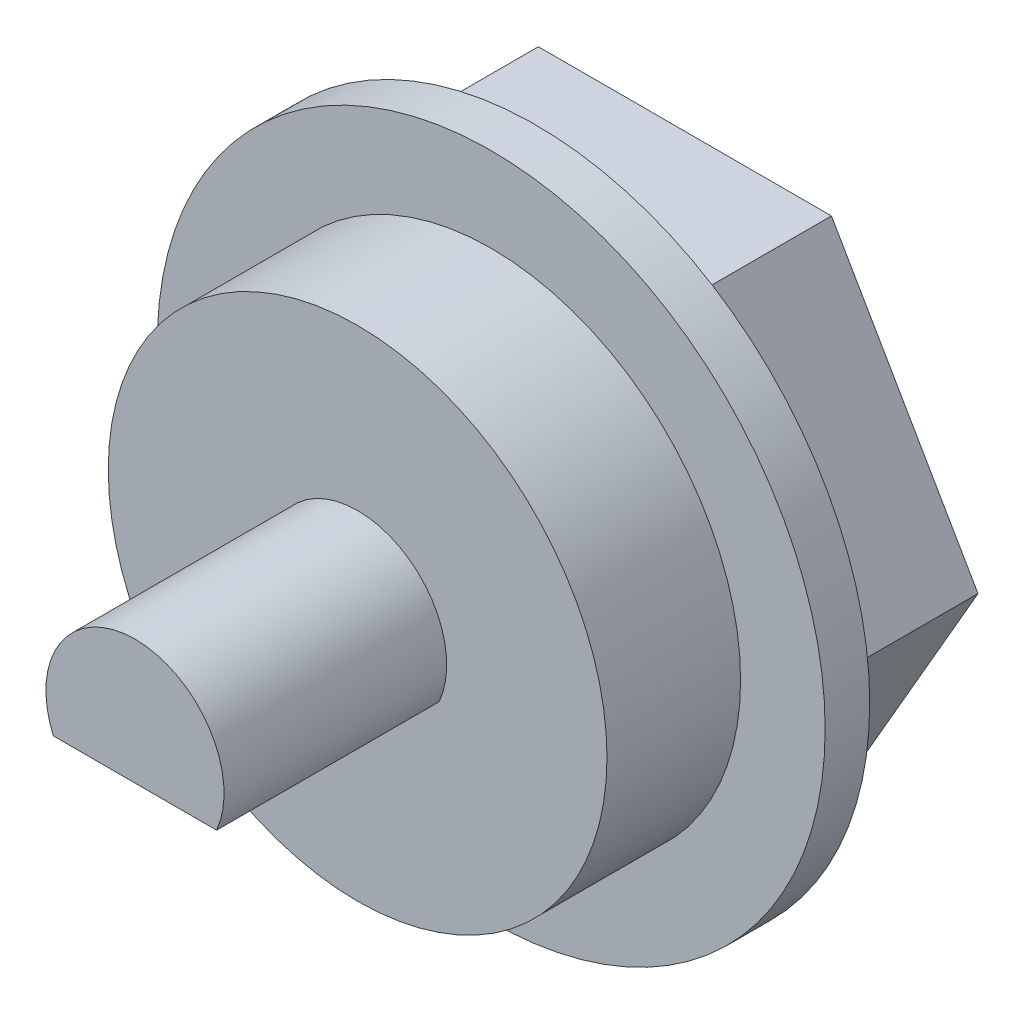
ISO-10303-21;
HEADER;
FILE_DESCRIPTION(('STEP AP214'),'2;1');
FILE_NAME('part.step','',(''),(''),'','','');
FILE_SCHEMA(('AUTOMOTIVE_DESIGN { 1 0 10303 214 1 1 1 1 }'));
ENDSEC;
DATA;
#1=APPLICATION_CONTEXT('core data for automotive mechanical design processes');
#2=APPLICATION_PROTOCOL_DEFINITION('international standard','automotive_design',2000,#1);
#3=PRODUCT_CONTEXT('',#1,'mechanical');
#4=PRODUCT('Part','Part','',(#3));
#5=PRODUCT_RELATED_PRODUCT_CATEGORY('part','',(#4));
#6=PRODUCT_DEFINITION_FORMATION('','',#4);
#7=PRODUCT_DEFINITION_CONTEXT('part definition',#1,'design');
#8=PRODUCT_DEFINITION('design','',#6,#7);
#9=PRODUCT_DEFINITION_SHAPE('','',#8);
#10=(LENGTH_UNIT() NAMED_UNIT(*) SI_UNIT(.MILLI.,.METRE.));
#11=(NAMED_UNIT(*) PLANE_ANGLE_UNIT() SI_UNIT($,.RADIAN.));
#12=(NAMED_UNIT(*) SI_UNIT($,.STERADIAN.) SOLID_ANGLE_UNIT());
#13=UNCERTAINTY_MEASURE_WITH_UNIT(LENGTH_MEASURE(1.E-05),#10,'distance_accuracy_value','');
#14=(GEOMETRIC_REPRESENTATION_CONTEXT(3) GLOBAL_UNCERTAINTY_ASSIGNED_CONTEXT((#13)) GLOBAL_UNIT_ASSIGNED_CONTEXT((#10,
#11,#12)) REPRESENTATION_CONTEXT('',''));
#15=CARTESIAN_POINT('',(0.,0.,0.));
#16=DIRECTION('',(0.,0.,1.));
#17=DIRECTION('',(1.,0.,0.));
#18=AXIS2_PLACEMENT_3D('',#15,#16,#17);
#19=CARTESIAN_POINT('',(0.,0.,4.));
#20=DIRECTION('',(0.,0.,1.));
#21=DIRECTION('',(1.,0.,0.));
#22=AXIS2_PLACEMENT_3D('',#19,#20,#21);
#23=PLANE('',#22);
#24=CARTESIAN_POINT('',(0.,0.,4.));
#25=DIRECTION('',(0.,0.,1.));
#26=DIRECTION('',(1.,0.,0.));
#27=AXIS2_PLACEMENT_3D('',#24,#25,#26);
#28=CIRCLE('',#27,5.6);
#29=CARTESIAN_POINT('',(5.6,0.,4.));
#30=VERTEX_POINT('',#29);
#31=EDGE_CURVE('E118',#30,#30,#28,.T.);
#32=ORIENTED_EDGE('',*,*,#31,.T.);
#33=EDGE_LOOP('',(#32));
#34=FACE_BOUND('',#33,.T.);
#35=DIRECTION('',(-1.,0.,0.));
#36=VECTOR('',#35,1.);
#37=CARTESIAN_POINT('',(0.,-0.8,4.));
#38=LINE('',#37,#36);
#39=CARTESIAN_POINT('',(1.83303027798234,-0.8,4.));
#40=VERTEX_POINT('',#39);
#41=CARTESIAN_POINT('',(-1.83303027798234,-0.8,4.));
#42=VERTEX_POINT('',#41);
#43=EDGE_CURVE('E49',#40,#42,#38,.T.);
#44=ORIENTED_EDGE('',*,*,#43,.T.);
#45=CARTESIAN_POINT('',(0.,0.,4.));
#46=DIRECTION('',(0.,0.,1.));
#47=DIRECTION('',(1.,0.,0.));
#48=AXIS2_PLACEMENT_3D('',#45,#46,#47);
#49=CIRCLE('',#48,2.);
#50=EDGE_CURVE('E11',#42,#40,#49,.F.);
#51=ORIENTED_EDGE('',*,*,#50,.T.);
#52=EDGE_LOOP('',(#44,#51));
#53=FACE_BOUND('',#52,.T.);
#54=ADVANCED_FACE('F41',(#34,#53),#23,.T.);
#55=CARTESIAN_POINT('',(0.,0.,1.));
#56=DIRECTION('',(0.,0.,-1.));
#57=DIRECTION('',(-1.,0.,0.));
#58=AXIS2_PLACEMENT_3D('',#55,#56,#57);
#59=CYLINDRICAL_SURFACE('',#58,7.5);
#60=CARTESIAN_POINT('',(0.,0.,1.));
#61=DIRECTION('',(0.,0.,1.));
#62=DIRECTION('',(1.,0.,0.));
#63=AXIS2_PLACEMENT_3D('',#60,#61,#62);
#64=CIRCLE('',#63,7.5);
#65=CARTESIAN_POINT('',(7.5,0.,1.));
#66=VERTEX_POINT('',#65);
#67=EDGE_CURVE('E127',#66,#66,#64,.T.);
#68=ORIENTED_EDGE('',*,*,#67,.F.);
#69=EDGE_LOOP('',(#68));
#70=FACE_BOUND('',#69,.T.);
#71=CARTESIAN_POINT('',(0.,0.,0.));
#72=DIRECTION('',(0.,0.,1.));
#73=DIRECTION('',(1.,0.,0.));
#74=AXIS2_PLACEMENT_3D('',#71,#72,#73);
#75=CIRCLE('',#74,7.5);
#76=CARTESIAN_POINT('',(7.5,0.,0.));
#77=VERTEX_POINT('',#76);
#78=EDGE_CURVE('E165',#77,#77,#75,.T.);
#79=ORIENTED_EDGE('',*,*,#78,.T.);
#80=EDGE_LOOP('',(#79));
#81=FACE_BOUND('',#80,.T.);
#82=ADVANCED_FACE('F43',(#70,#81),#59,.T.);
#83=CARTESIAN_POINT('',(0.,0.,1.));
#84=DIRECTION('',(0.,0.,1.));
#85=DIRECTION('',(1.,0.,0.));
#86=AXIS2_PLACEMENT_3D('',#83,#84,#85);
#87=PLANE('',#86);
#88=CARTESIAN_POINT('',(0.,0.,1.));
#89=DIRECTION('',(0.,0.,1.));
#90=DIRECTION('',(1.,0.,0.));
#91=AXIS2_PLACEMENT_3D('',#88,#89,#90);
#92=CIRCLE('',#91,5.6);
#93=CARTESIAN_POINT('',(5.6,0.,1.));
#94=VERTEX_POINT('',#93);
#95=EDGE_CURVE('E124',#94,#94,#92,.T.);
#96=ORIENTED_EDGE('',*,*,#95,.F.);
#97=EDGE_LOOP('',(#96));
#98=FACE_BOUND('',#97,.T.);
#99=ORIENTED_EDGE('',*,*,#67,.T.);
#100=EDGE_LOOP('',(#99));
#101=FACE_BOUND('',#100,.T.);
#102=ADVANCED_FACE('F187',(#98,#101),#87,.T.);
#103=CARTESIAN_POINT('',(0.,0.,0.));
#104=DIRECTION('',(0.,0.,1.));
#105=DIRECTION('',(1.,0.,0.));
#106=AXIS2_PLACEMENT_3D('',#103,#104,#105);
#107=PLANE('',#106);
#108=DIRECTION('',(-1.,0.,0.));
#109=VECTOR('',#108,1.);
#110=CARTESIAN_POINT('',(0.,5.69999999999999,0.));
#111=LINE('',#110,#109);
#112=CARTESIAN_POINT('',(3.29089653438088,5.69999999999999,0.));
#113=VERTEX_POINT('',#112);
#114=CARTESIAN_POINT('',(-3.29089653438085,5.69999999999999,0.));
#115=VERTEX_POINT('',#114);
#116=EDGE_CURVE('E132',#113,#115,#111,.T.);
#117=ORIENTED_EDGE('',*,*,#116,.T.);
#118=DIRECTION('',(-0.499999999999998,-0.86602540378444,0.));
#119=VECTOR('',#118,1.);
#120=CARTESIAN_POINT('',(-4.93634480157128,2.84999999999997,0.));
#121=LINE('',#120,#119);
#122=CARTESIAN_POINT('',(-6.58179306876169,0.,0.));
#123=VERTEX_POINT('',#122);
#124=EDGE_CURVE('E64',#115,#123,#121,.T.);
#125=ORIENTED_EDGE('',*,*,#124,.T.);
#126=DIRECTION('',(0.499999999999998,-0.86602540378444,0.));
#127=VECTOR('',#126,1.);
#128=CARTESIAN_POINT('',(-4.93634480157129,-2.84999999999998,0.));
#129=LINE('',#128,#127);
#130=CARTESIAN_POINT('',(-3.29089653438084,-5.70000000000001,0.));
#131=VERTEX_POINT('',#130);
#132=EDGE_CURVE('E149',#123,#131,#129,.T.);
#133=ORIENTED_EDGE('',*,*,#132,.T.);
#134=DIRECTION('',(1.,0.,0.));
#135=VECTOR('',#134,1.);
#136=CARTESIAN_POINT('',(0.,-5.70000000000001,0.));
#137=LINE('',#136,#135);
#138=CARTESIAN_POINT('',(3.29089653438088,-5.70000000000001,0.));
#139=VERTEX_POINT('',#138);
#140=EDGE_CURVE('E152',#131,#139,#137,.T.);
#141=ORIENTED_EDGE('',*,*,#140,.T.);
#142=DIRECTION('',(0.499999999999998,0.86602540378444,0.));
#143=VECTOR('',#142,1.);
#144=CARTESIAN_POINT('',(4.93634480157132,-2.84999999999999,0.));
#145=LINE('',#144,#143);
#146=CARTESIAN_POINT('',(6.58179306876173,0.,0.));
#147=VERTEX_POINT('',#146);
#148=EDGE_CURVE('E155',#139,#147,#145,.T.);
#149=ORIENTED_EDGE('',*,*,#148,.T.);
#150=DIRECTION('',(-0.499999999999998,0.86602540378444,0.));
#151=VECTOR('',#150,1.);
#152=CARTESIAN_POINT('',(4.93634480157131,2.84999999999999,0.));
#153=LINE('',#152,#151);
#154=EDGE_CURVE('E158',#147,#113,#153,.T.);
#155=ORIENTED_EDGE('',*,*,#154,.T.);
#156=EDGE_LOOP('',(#117,#125,#133,#141,#149,#155));
#157=FACE_BOUND('',#156,.T.);
#158=ORIENTED_EDGE('',*,*,#78,.F.);
#159=EDGE_LOOP('',(#158));
#160=FACE_BOUND('',#159,.T.);
#161=ADVANCED_FACE('F222',(#157,#160),#107,.F.);
#162=CARTESIAN_POINT('',(-4.93634480157128,2.84999999999997,-3.35));
#163=DIRECTION('',(-0.86602540378444,0.499999999999998,0.));
#164=DIRECTION('',(-0.499999999999998,-0.86602540378444,0.));
#165=AXIS2_PLACEMENT_3D('',#162,#163,#164);
#166=PLANE('',#165);
#167=ORIENTED_EDGE('',*,*,#124,.F.);
#168=DIRECTION('',(0.,0.,1.));
#169=VECTOR('',#168,1.);
#170=CARTESIAN_POINT('',(-3.29089653438085,5.69999999999999,-3.35));
#171=LINE('',#170,#169);
#172=CARTESIAN_POINT('',(-3.29089653438085,5.69999999999999,-3.35));
#173=VERTEX_POINT('',#172);
#174=EDGE_CURVE('E163',#173,#115,#171,.T.);
#175=ORIENTED_EDGE('',*,*,#174,.F.);
#176=DIRECTION('',(-0.499999999999998,-0.86602540378444,0.));
#177=VECTOR('',#176,1.);
#178=CARTESIAN_POINT('',(-4.93634480157128,2.84999999999997,-3.35));
#179=LINE('',#178,#177);
#180=CARTESIAN_POINT('',(-6.58179306876169,0.,-3.35));
#181=VERTEX_POINT('',#180);
#182=EDGE_CURVE('E128',#173,#181,#179,.T.);
#183=ORIENTED_EDGE('',*,*,#182,.T.);
#184=DIRECTION('',(0.,0.,1.));
#185=VECTOR('',#184,1.);
#186=CARTESIAN_POINT('',(-6.58179306876169,0.,-3.35));
#187=LINE('',#186,#185);
#188=EDGE_CURVE('E147',#181,#123,#187,.T.);
#189=ORIENTED_EDGE('',*,*,#188,.T.);
#190=EDGE_LOOP('',(#167,#175,#183,#189));
#191=FACE_BOUND('',#190,.T.);
#192=ADVANCED_FACE('F204',(#191),#166,.T.);
#193=CARTESIAN_POINT('',(0.,5.69999999999999,-3.35));
#194=DIRECTION('',(0.,1.,0.));
#195=DIRECTION('',(-1.,0.,0.));
#196=AXIS2_PLACEMENT_3D('',#193,#194,#195);
#197=PLANE('',#196);
#198=ORIENTED_EDGE('',*,*,#116,.F.);
#199=DIRECTION('',(0.,0.,1.));
#200=VECTOR('',#199,1.);
#201=CARTESIAN_POINT('',(3.29089653438088,5.69999999999999,-3.35));
#202=LINE('',#201,#200);
#203=CARTESIAN_POINT('',(3.29089653438088,5.69999999999999,-3.35));
#204=VERTEX_POINT('',#203);
#205=EDGE_CURVE('E166',#204,#113,#202,.T.);
#206=ORIENTED_EDGE('',*,*,#205,.F.);
#207=DIRECTION('',(-1.,0.,0.));
#208=VECTOR('',#207,1.);
#209=CARTESIAN_POINT('',(0.,5.69999999999999,-3.35));
#210=LINE('',#209,#208);
#211=EDGE_CURVE('E144',#204,#173,#210,.T.);
#212=ORIENTED_EDGE('',*,*,#211,.T.);
#213=ORIENTED_EDGE('',*,*,#174,.T.);
#214=EDGE_LOOP('',(#198,#206,#212,#213));
#215=FACE_BOUND('',#214,.T.);
#216=ADVANCED_FACE('F200',(#215),#197,.T.);
#217=CARTESIAN_POINT('',(4.93634480157131,2.84999999999999,-3.35));
#218=DIRECTION('',(0.86602540378444,0.499999999999998,0.));
#219=DIRECTION('',(-0.499999999999998,0.86602540378444,0.));
#220=AXIS2_PLACEMENT_3D('',#217,#218,#219);
#221=PLANE('',#220);
#222=ORIENTED_EDGE('',*,*,#154,.F.);
#223=DIRECTION('',(0.,0.,1.));
#224=VECTOR('',#223,1.);
#225=CARTESIAN_POINT('',(6.58179306876173,0.,-3.35));
#226=LINE('',#225,#224);
#227=CARTESIAN_POINT('',(6.58179306876173,0.,-3.35));
#228=VERTEX_POINT('',#227);
#229=EDGE_CURVE('E168',#228,#147,#226,.T.);
#230=ORIENTED_EDGE('',*,*,#229,.F.);
#231=DIRECTION('',(-0.499999999999998,0.86602540378444,0.));
#232=VECTOR('',#231,1.);
#233=CARTESIAN_POINT('',(4.93634480157131,2.84999999999999,-3.35));
#234=LINE('',#233,#232);
#235=EDGE_CURVE('E141',#228,#204,#234,.T.);
#236=ORIENTED_EDGE('',*,*,#235,.T.);
#237=ORIENTED_EDGE('',*,*,#205,.T.);
#238=EDGE_LOOP('',(#222,#230,#236,#237));
#239=FACE_BOUND('',#238,.T.);
#240=ADVANCED_FACE('F203',(#239),#221,.T.);
#241=CARTESIAN_POINT('',(4.93634480157132,-2.84999999999999,-3.35));
#242=DIRECTION('',(0.86602540378444,-0.499999999999998,0.));
#243=DIRECTION('',(0.499999999999998,0.86602540378444,0.));
#244=AXIS2_PLACEMENT_3D('',#241,#242,#243);
#245=PLANE('',#244);
#246=ORIENTED_EDGE('',*,*,#148,.F.);
#247=DIRECTION('',(0.,0.,1.));
#248=VECTOR('',#247,1.);
#249=CARTESIAN_POINT('',(3.29089653438088,-5.70000000000001,-3.35));
#250=LINE('',#249,#248);
#251=CARTESIAN_POINT('',(3.29089653438088,-5.70000000000001,-3.35));
#252=VERTEX_POINT('',#251);
#253=EDGE_CURVE('E170',#252,#139,#250,.T.);
#254=ORIENTED_EDGE('',*,*,#253,.F.);
#255=DIRECTION('',(0.499999999999998,0.86602540378444,0.));
#256=VECTOR('',#255,1.);
#257=CARTESIAN_POINT('',(4.93634480157132,-2.84999999999999,-3.35));
#258=LINE('',#257,#256);
#259=EDGE_CURVE('E138',#252,#228,#258,.T.);
#260=ORIENTED_EDGE('',*,*,#259,.T.);
#261=ORIENTED_EDGE('',*,*,#229,.T.);
#262=EDGE_LOOP('',(#246,#254,#260,#261));
#263=FACE_BOUND('',#262,.T.);
#264=ADVANCED_FACE('F208',(#263),#245,.T.);
#265=CARTESIAN_POINT('',(0.,-5.70000000000001,-3.35));
#266=DIRECTION('',(0.,-1.,0.));
#267=DIRECTION('',(0.,0.,-1.));
#268=AXIS2_PLACEMENT_3D('',#265,#266,#267);
#269=PLANE('',#268);
#270=ORIENTED_EDGE('',*,*,#140,.F.);
#271=DIRECTION('',(0.,0.,1.));
#272=VECTOR('',#271,1.);
#273=CARTESIAN_POINT('',(-3.29089653438084,-5.70000000000001,-3.35));
#274=LINE('',#273,#272);
#275=CARTESIAN_POINT('',(-3.29089653438084,-5.70000000000001,-3.35));
#276=VERTEX_POINT('',#275);
#277=EDGE_CURVE('E172',#276,#131,#274,.T.);
#278=ORIENTED_EDGE('',*,*,#277,.F.);
#279=DIRECTION('',(1.,0.,0.));
#280=VECTOR('',#279,1.);
#281=CARTESIAN_POINT('',(0.,-5.70000000000001,-3.35));
#282=LINE('',#281,#280);
#283=EDGE_CURVE('E135',#276,#252,#282,.T.);
#284=ORIENTED_EDGE('',*,*,#283,.T.);
#285=ORIENTED_EDGE('',*,*,#253,.T.);
#286=EDGE_LOOP('',(#270,#278,#284,#285));
#287=FACE_BOUND('',#286,.T.);
#288=ADVANCED_FACE('F212',(#287),#269,.T.);
#289=CARTESIAN_POINT('',(-4.93634480157129,-2.84999999999998,-3.35));
#290=DIRECTION('',(-0.86602540378444,-0.499999999999998,0.));
#291=DIRECTION('',(0.499999999999998,-0.86602540378444,0.));
#292=AXIS2_PLACEMENT_3D('',#289,#290,#291);
#293=PLANE('',#292);
#294=ORIENTED_EDGE('',*,*,#132,.F.);
#295=ORIENTED_EDGE('',*,*,#188,.F.);
#296=DIRECTION('',(0.499999999999998,-0.86602540378444,0.));
#297=VECTOR('',#296,1.);
#298=CARTESIAN_POINT('',(-4.93634480157129,-2.84999999999998,-3.35));
#299=LINE('',#298,#297);
#300=EDGE_CURVE('E131',#181,#276,#299,.T.);
#301=ORIENTED_EDGE('',*,*,#300,.T.);
#302=ORIENTED_EDGE('',*,*,#277,.T.);
#303=EDGE_LOOP('',(#294,#295,#301,#302));
#304=FACE_BOUND('',#303,.T.);
#305=ADVANCED_FACE('F198',(#304),#293,.T.);
#306=CARTESIAN_POINT('',(0.,0.,-3.35));
#307=DIRECTION('',(0.,0.,1.));
#308=DIRECTION('',(1.,0.,0.));
#309=AXIS2_PLACEMENT_3D('',#306,#307,#308);
#310=PLANE('',#309);
#311=ORIENTED_EDGE('',*,*,#182,.F.);
#312=ORIENTED_EDGE('',*,*,#211,.F.);
#313=ORIENTED_EDGE('',*,*,#235,.F.);
#314=ORIENTED_EDGE('',*,*,#259,.F.);
#315=ORIENTED_EDGE('',*,*,#283,.F.);
#316=ORIENTED_EDGE('',*,*,#300,.F.);
#317=EDGE_LOOP('',(#311,#312,#313,#314,#315,#316));
#318=FACE_BOUND('',#317,.T.);
#319=ADVANCED_FACE('F194',(#318),#310,.F.);
#320=CARTESIAN_POINT('',(0.,0.,4.));
#321=DIRECTION('',(0.,0.,-1.));
#322=DIRECTION('',(-1.,0.,0.));
#323=AXIS2_PLACEMENT_3D('',#320,#321,#322);
#324=CYLINDRICAL_SURFACE('',#323,5.6);
#325=ORIENTED_EDGE('',*,*,#31,.F.);
#326=EDGE_LOOP('',(#325));
#327=FACE_BOUND('',#326,.T.);
#328=ORIENTED_EDGE('',*,*,#95,.T.);
#329=EDGE_LOOP('',(#328));
#330=FACE_BOUND('',#329,.T.);
#331=ADVANCED_FACE('F192',(#327,#330),#324,.T.);
#332=CARTESIAN_POINT('',(0.,0.,9.));
#333=DIRECTION('',(0.,0.,-1.));
#334=DIRECTION('',(-1.,0.,0.));
#335=AXIS2_PLACEMENT_3D('',#332,#333,#334);
#336=CYLINDRICAL_SURFACE('',#335,2.);
#337=ORIENTED_EDGE('',*,*,#50,.F.);
#338=DIRECTION('',(0.,0.,-1.));
#339=VECTOR('',#338,1.);
#340=CARTESIAN_POINT('',(-1.83303027798234,-0.8,9.));
#341=LINE('',#340,#339);
#342=CARTESIAN_POINT('',(-1.83303027798234,-0.8,9.));
#343=VERTEX_POINT('',#342);
#344=EDGE_CURVE('E56',#343,#42,#341,.T.);
#345=ORIENTED_EDGE('',*,*,#344,.F.);
#346=CARTESIAN_POINT('',(0.,0.,9.));
#347=DIRECTION('',(0.,0.,1.));
#348=DIRECTION('',(-1.,0.,0.));
#349=AXIS2_PLACEMENT_3D('',#346,#347,#348);
#350=CIRCLE('',#349,2.);
#351=CARTESIAN_POINT('',(1.83303027798234,-0.8,9.));
#352=VERTEX_POINT('',#351);
#353=EDGE_CURVE('E111',#352,#343,#350,.T.);
#354=ORIENTED_EDGE('',*,*,#353,.F.);
#355=DIRECTION('',(0.,0.,-1.));
#356=VECTOR('',#355,1.);
#357=CARTESIAN_POINT('',(1.83303027798234,-0.8,9.));
#358=LINE('',#357,#356);
#359=EDGE_CURVE('E108',#352,#40,#358,.T.);
#360=ORIENTED_EDGE('',*,*,#359,.T.);
#361=EDGE_LOOP('',(#337,#345,#354,#360));
#362=FACE_BOUND('',#361,.T.);
#363=ADVANCED_FACE('F116',(#362),#336,.T.);
#364=CARTESIAN_POINT('',(-1.83303027798234,-0.8,9.));
#365=DIRECTION('',(0.,1.,0.));
#366=DIRECTION('',(0.,0.,1.));
#367=AXIS2_PLACEMENT_3D('',#364,#365,#366);
#368=PLANE('',#367);
#369=ORIENTED_EDGE('',*,*,#43,.F.);
#370=ORIENTED_EDGE('',*,*,#359,.F.);
#371=DIRECTION('',(1.,0.,0.));
#372=VECTOR('',#371,1.);
#373=CARTESIAN_POINT('',(-1.83303027798234,-0.8,9.));
#374=LINE('',#373,#372);
#375=EDGE_CURVE('E104',#343,#352,#374,.T.);
#376=ORIENTED_EDGE('',*,*,#375,.F.);
#377=ORIENTED_EDGE('',*,*,#344,.T.);
#378=EDGE_LOOP('',(#369,#370,#376,#377));
#379=FACE_BOUND('',#378,.T.);
#380=ADVANCED_FACE('F106',(#379),#368,.F.);
#381=CARTESIAN_POINT('',(0.,0.,9.));
#382=DIRECTION('',(0.,0.,-1.));
#383=DIRECTION('',(-1.,0.,0.));
#384=AXIS2_PLACEMENT_3D('',#381,#382,#383);
#385=PLANE('',#384);
#386=ORIENTED_EDGE('',*,*,#353,.T.);
#387=ORIENTED_EDGE('',*,*,#375,.T.);
#388=EDGE_LOOP('',(#386,#387));
#389=FACE_BOUND('',#388,.T.);
#390=ADVANCED_FACE('F113',(#389),#385,.F.);
#391=CLOSED_SHELL('',(#54,#82,#102,#161,#192,#216,#240,#264,#288,#305,#319,#331,#363,#380,#390));
#392=MANIFOLD_SOLID_BREP('B2',#391);
#393=ADVANCED_BREP_SHAPE_REPRESENTATION('',(#18,#392),#14);
#394=SHAPE_DEFINITION_REPRESENTATION(#9,#393);
ENDSEC;
END-ISO-10303-21;
